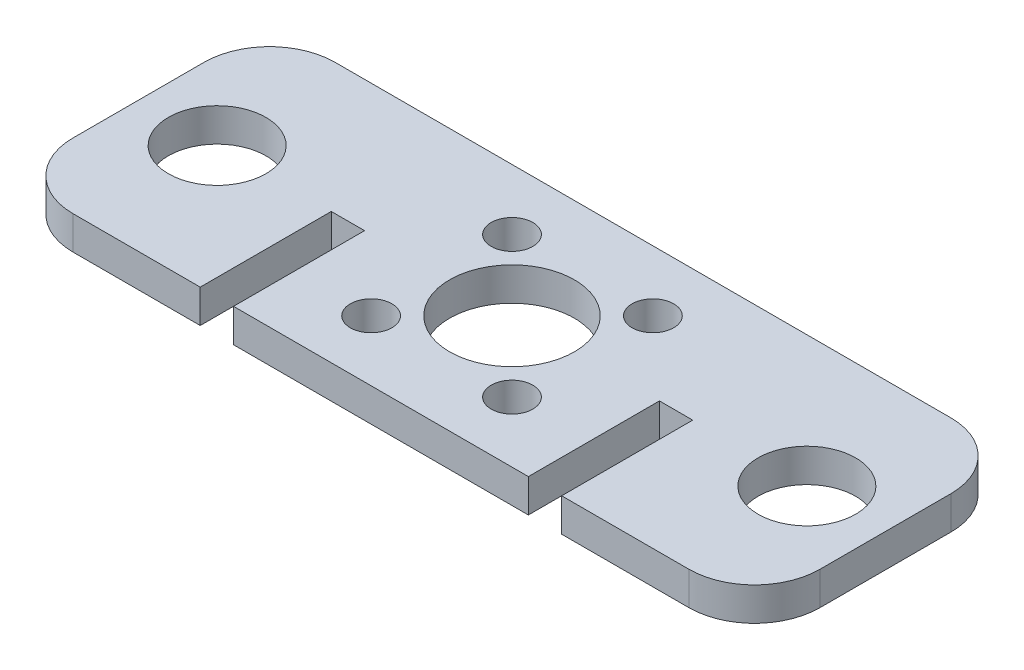
ISO-10303-21;
HEADER;
FILE_DESCRIPTION(('STEP AP214'),'2;1');
FILE_NAME('part.step','',(''),(''),'','','');
FILE_SCHEMA(('AUTOMOTIVE_DESIGN { 1 0 10303 214 1 1 1 1 }'));
ENDSEC;
DATA;
#1=APPLICATION_CONTEXT('core data for automotive mechanical design processes');
#2=APPLICATION_PROTOCOL_DEFINITION('international standard','automotive_design',2000,#1);
#3=PRODUCT_CONTEXT('',#1,'mechanical');
#4=PRODUCT('Part','Part','',(#3));
#5=PRODUCT_RELATED_PRODUCT_CATEGORY('part','',(#4));
#6=PRODUCT_DEFINITION_FORMATION('','',#4);
#7=PRODUCT_DEFINITION_CONTEXT('part definition',#1,'design');
#8=PRODUCT_DEFINITION('design','',#6,#7);
#9=PRODUCT_DEFINITION_SHAPE('','',#8);
#10=(LENGTH_UNIT() NAMED_UNIT(*) SI_UNIT(.MILLI.,.METRE.));
#11=(NAMED_UNIT(*) PLANE_ANGLE_UNIT() SI_UNIT($,.RADIAN.));
#12=(NAMED_UNIT(*) SI_UNIT($,.STERADIAN.) SOLID_ANGLE_UNIT());
#13=UNCERTAINTY_MEASURE_WITH_UNIT(LENGTH_MEASURE(1.E-05),#10,'distance_accuracy_value','');
#14=(GEOMETRIC_REPRESENTATION_CONTEXT(3) GLOBAL_UNCERTAINTY_ASSIGNED_CONTEXT((#13)) GLOBAL_UNIT_ASSIGNED_CONTEXT((#10,
#11,#12)) REPRESENTATION_CONTEXT('',''));
#15=CARTESIAN_POINT('',(0.,0.,0.));
#16=DIRECTION('',(0.,0.,1.));
#17=DIRECTION('',(1.,0.,0.));
#18=AXIS2_PLACEMENT_3D('',#15,#16,#17);
#19=CARTESIAN_POINT('',(57.,5.08,20.));
#20=DIRECTION('',(0.,0.,-1.));
#21=DIRECTION('',(-1.,0.,0.));
#22=AXIS2_PLACEMENT_3D('',#19,#20,#21);
#23=PLANE('',#22);
#24=DIRECTION('',(1.,0.,0.));
#25=VECTOR('',#24,1.);
#26=CARTESIAN_POINT('',(57.,5.08,20.));
#27=LINE('',#26,#25);
#28=CARTESIAN_POINT('',(27.58,5.08,20.));
#29=VERTEX_POINT('',#28);
#30=CARTESIAN_POINT('',(47.,5.08,20.));
#31=VERTEX_POINT('',#30);
#32=EDGE_CURVE('E232',#29,#31,#27,.T.);
#33=ORIENTED_EDGE('',*,*,#32,.F.);
#34=DIRECTION('',(0.,1.,0.));
#35=VECTOR('',#34,1.);
#36=CARTESIAN_POINT('',(27.58,0.,20.));
#37=LINE('',#36,#35);
#38=CARTESIAN_POINT('',(27.58,0.,20.));
#39=VERTEX_POINT('',#38);
#40=EDGE_CURVE('E181',#39,#29,#37,.T.);
#41=ORIENTED_EDGE('',*,*,#40,.F.);
#42=DIRECTION('',(1.,0.,0.));
#43=VECTOR('',#42,1.);
#44=CARTESIAN_POINT('',(57.,0.,20.));
#45=LINE('',#44,#43);
#46=CARTESIAN_POINT('',(47.,0.,20.));
#47=VERTEX_POINT('',#46);
#48=EDGE_CURVE('E169',#39,#47,#45,.T.);
#49=ORIENTED_EDGE('',*,*,#48,.T.);
#50=DIRECTION('',(0.,-1.,0.));
#51=VECTOR('',#50,1.);
#52=CARTESIAN_POINT('',(47.,5.08,20.));
#53=LINE('',#52,#51);
#54=EDGE_CURVE('E284',#47,#31,#53,.F.);
#55=ORIENTED_EDGE('',*,*,#54,.T.);
#56=EDGE_LOOP('',(#33,#41,#49,#55));
#57=FACE_BOUND('',#56,.T.);
#58=ADVANCED_FACE('F32',(#57),#23,.F.);
#59=CARTESIAN_POINT('',(-47.,0.,20.));
#60=VERTEX_POINT('',#59);
#61=CARTESIAN_POINT('',(-27.58,0.,20.));
#62=VERTEX_POINT('',#61);
#63=EDGE_CURVE('E247',#60,#62,#45,.T.);
#64=ORIENTED_EDGE('',*,*,#63,.T.);
#65=DIRECTION('',(0.,1.,0.));
#66=VECTOR('',#65,1.);
#67=CARTESIAN_POINT('',(-27.58,0.,20.));
#68=LINE('',#67,#66);
#69=CARTESIAN_POINT('',(-27.58,5.08,20.));
#70=VERTEX_POINT('',#69);
#71=EDGE_CURVE('E195',#62,#70,#68,.T.);
#72=ORIENTED_EDGE('',*,*,#71,.T.);
#73=CARTESIAN_POINT('',(-47.,5.08,20.));
#74=VERTEX_POINT('',#73);
#75=EDGE_CURVE('E234',#74,#70,#27,.T.);
#76=ORIENTED_EDGE('',*,*,#75,.F.);
#77=DIRECTION('',(0.,-1.,0.));
#78=VECTOR('',#77,1.);
#79=CARTESIAN_POINT('',(-47.,5.08,20.));
#80=LINE('',#79,#78);
#81=EDGE_CURVE('E281',#74,#60,#80,.T.);
#82=ORIENTED_EDGE('',*,*,#81,.T.);
#83=EDGE_LOOP('',(#64,#72,#76,#82));
#84=FACE_BOUND('',#83,.T.);
#85=ADVANCED_FACE('F302',(#84),#23,.F.);
#86=CARTESIAN_POINT('',(0.,5.08,0.));
#87=DIRECTION('',(0.,1.,0.));
#88=DIRECTION('',(0.,0.,1.));
#89=AXIS2_PLACEMENT_3D('',#86,#87,#88);
#90=PLANE('',#89);
#91=CARTESIAN_POINT('',(10.75,5.08,-10.75));
#92=DIRECTION('',(0.,1.,0.));
#93=DIRECTION('',(0.,0.,1.));
#94=AXIS2_PLACEMENT_3D('',#91,#92,#93);
#95=CIRCLE('',#94,3.175);
#96=CARTESIAN_POINT('',(10.75,5.08,-7.57499999999999));
#97=VERTEX_POINT('',#96);
#98=EDGE_CURVE('E548',#97,#97,#95,.T.);
#99=ORIENTED_EDGE('',*,*,#98,.F.);
#100=EDGE_LOOP('',(#99));
#101=FACE_BOUND('',#100,.T.);
#102=CARTESIAN_POINT('',(-10.75,5.08,-10.75));
#103=DIRECTION('',(0.,1.,0.));
#104=DIRECTION('',(0.,0.,1.));
#105=AXIS2_PLACEMENT_3D('',#102,#103,#104);
#106=CIRCLE('',#105,3.175);
#107=CARTESIAN_POINT('',(-10.75,5.08,-7.575));
#108=VERTEX_POINT('',#107);
#109=EDGE_CURVE('E550',#108,#108,#106,.T.);
#110=ORIENTED_EDGE('',*,*,#109,.F.);
#111=EDGE_LOOP('',(#110));
#112=FACE_BOUND('',#111,.T.);
#113=CARTESIAN_POINT('',(-10.75,5.08,10.75));
#114=DIRECTION('',(0.,1.,0.));
#115=DIRECTION('',(0.,0.,1.));
#116=AXIS2_PLACEMENT_3D('',#113,#114,#115);
#117=CIRCLE('',#116,3.175);
#118=CARTESIAN_POINT('',(-10.75,5.08,13.925));
#119=VERTEX_POINT('',#118);
#120=EDGE_CURVE('E556',#119,#119,#117,.T.);
#121=ORIENTED_EDGE('',*,*,#120,.F.);
#122=EDGE_LOOP('',(#121));
#123=FACE_BOUND('',#122,.T.);
#124=CARTESIAN_POINT('',(10.75,5.08,10.75));
#125=DIRECTION('',(0.,1.,0.));
#126=DIRECTION('',(0.,0.,1.));
#127=AXIS2_PLACEMENT_3D('',#124,#125,#126);
#128=CIRCLE('',#127,3.175);
#129=CARTESIAN_POINT('',(10.75,5.08,13.925));
#130=VERTEX_POINT('',#129);
#131=EDGE_CURVE('E174',#130,#130,#128,.T.);
#132=ORIENTED_EDGE('',*,*,#131,.F.);
#133=EDGE_LOOP('',(#132));
#134=FACE_BOUND('',#133,.T.);
#135=DIRECTION('',(0.,0.,-1.));
#136=VECTOR('',#135,1.);
#137=CARTESIAN_POINT('',(27.58,5.08,20.));
#138=LINE('',#137,#136);
#139=CARTESIAN_POINT('',(27.58,5.08,0.));
#140=VERTEX_POINT('',#139);
#141=EDGE_CURVE('E151',#29,#140,#138,.T.);
#142=ORIENTED_EDGE('',*,*,#141,.F.);
#143=ORIENTED_EDGE('',*,*,#32,.T.);
#144=CARTESIAN_POINT('',(47.,5.08,9.99999999999999));
#145=DIRECTION('',(0.,1.,0.));
#146=DIRECTION('',(0.,0.,1.));
#147=AXIS2_PLACEMENT_3D('',#144,#145,#146);
#148=CIRCLE('',#147,10.);
#149=CARTESIAN_POINT('',(57.,5.08,9.99999999999999));
#150=VERTEX_POINT('',#149);
#151=EDGE_CURVE('E277',#31,#150,#148,.T.);
#152=ORIENTED_EDGE('',*,*,#151,.T.);
#153=DIRECTION('',(0.,0.,-1.));
#154=VECTOR('',#153,1.);
#155=CARTESIAN_POINT('',(57.,5.08,20.));
#156=LINE('',#155,#154);
#157=CARTESIAN_POINT('',(57.,5.08,-10.));
#158=VERTEX_POINT('',#157);
#159=EDGE_CURVE('E237',#150,#158,#156,.T.);
#160=ORIENTED_EDGE('',*,*,#159,.T.);
#161=CARTESIAN_POINT('',(47.,5.08,-10.));
#162=DIRECTION('',(0.,1.,0.));
#163=DIRECTION('',(0.,0.,1.));
#164=AXIS2_PLACEMENT_3D('',#161,#162,#163);
#165=CIRCLE('',#164,10.);
#166=CARTESIAN_POINT('',(47.,5.08,-20.));
#167=VERTEX_POINT('',#166);
#168=EDGE_CURVE('E279',#158,#167,#165,.T.);
#169=ORIENTED_EDGE('',*,*,#168,.T.);
#170=DIRECTION('',(-1.,0.,0.));
#171=VECTOR('',#170,1.);
#172=CARTESIAN_POINT('',(57.,5.08,-20.));
#173=LINE('',#172,#171);
#174=CARTESIAN_POINT('',(-47.,5.08,-20.));
#175=VERTEX_POINT('',#174);
#176=EDGE_CURVE('E241',#167,#175,#173,.T.);
#177=ORIENTED_EDGE('',*,*,#176,.T.);
#178=CARTESIAN_POINT('',(-47.,5.08,-9.99999999999999));
#179=DIRECTION('',(0.,1.,0.));
#180=DIRECTION('',(0.,0.,1.));
#181=AXIS2_PLACEMENT_3D('',#178,#179,#180);
#182=CIRCLE('',#181,10.);
#183=CARTESIAN_POINT('',(-57.,5.08,-9.99999999999999));
#184=VERTEX_POINT('',#183);
#185=EDGE_CURVE('E275',#175,#184,#182,.T.);
#186=ORIENTED_EDGE('',*,*,#185,.T.);
#187=DIRECTION('',(0.,0.,1.));
#188=VECTOR('',#187,1.);
#189=CARTESIAN_POINT('',(-57.,5.08,20.));
#190=LINE('',#189,#188);
#191=CARTESIAN_POINT('',(-57.,5.08,10.));
#192=VERTEX_POINT('',#191);
#193=EDGE_CURVE('E229',#184,#192,#190,.T.);
#194=ORIENTED_EDGE('',*,*,#193,.T.);
#195=CARTESIAN_POINT('',(-47.,5.08,10.));
#196=DIRECTION('',(0.,1.,0.));
#197=DIRECTION('',(0.,0.,1.));
#198=AXIS2_PLACEMENT_3D('',#195,#196,#197);
#199=CIRCLE('',#198,10.);
#200=EDGE_CURVE('E273',#192,#74,#199,.T.);
#201=ORIENTED_EDGE('',*,*,#200,.T.);
#202=ORIENTED_EDGE('',*,*,#75,.T.);
#203=DIRECTION('',(0.,0.,1.));
#204=VECTOR('',#203,1.);
#205=CARTESIAN_POINT('',(-27.58,5.08,20.));
#206=LINE('',#205,#204);
#207=CARTESIAN_POINT('',(-27.58,5.08,0.));
#208=VERTEX_POINT('',#207);
#209=EDGE_CURVE('E183',#208,#70,#206,.T.);
#210=ORIENTED_EDGE('',*,*,#209,.F.);
#211=DIRECTION('',(-1.,0.,0.));
#212=VECTOR('',#211,1.);
#213=CARTESIAN_POINT('',(-27.58,5.08,0.));
#214=LINE('',#213,#212);
#215=CARTESIAN_POINT('',(-22.5,5.08,0.));
#216=VERTEX_POINT('',#215);
#217=EDGE_CURVE('E190',#216,#208,#214,.T.);
#218=ORIENTED_EDGE('',*,*,#217,.F.);
#219=DIRECTION('',(0.,0.,-1.));
#220=VECTOR('',#219,1.);
#221=CARTESIAN_POINT('',(-22.5,5.08,20.));
#222=LINE('',#221,#220);
#223=CARTESIAN_POINT('',(-22.5,5.08,20.));
#224=VERTEX_POINT('',#223);
#225=EDGE_CURVE('E197',#224,#216,#222,.T.);
#226=ORIENTED_EDGE('',*,*,#225,.F.);
#227=CARTESIAN_POINT('',(22.5,5.08,20.));
#228=VERTEX_POINT('',#227);
#229=EDGE_CURVE('E238',#224,#228,#27,.T.);
#230=ORIENTED_EDGE('',*,*,#229,.T.);
#231=DIRECTION('',(0.,0.,1.));
#232=VECTOR('',#231,1.);
#233=CARTESIAN_POINT('',(22.5,5.08,20.));
#234=LINE('',#233,#232);
#235=CARTESIAN_POINT('',(22.5,5.08,0.));
#236=VERTEX_POINT('',#235);
#237=EDGE_CURVE('E47',#236,#228,#234,.T.);
#238=ORIENTED_EDGE('',*,*,#237,.F.);
#239=DIRECTION('',(-1.,0.,0.));
#240=VECTOR('',#239,1.);
#241=CARTESIAN_POINT('',(27.58,5.08,0.));
#242=LINE('',#241,#240);
#243=EDGE_CURVE('E171',#140,#236,#242,.T.);
#244=ORIENTED_EDGE('',*,*,#243,.F.);
#245=EDGE_LOOP('',(#142,#143,#152,#160,#169,#177,#186,#194,#201,#202,#210,#218,#226,#230,#238,#244));
#246=FACE_BOUND('',#245,.T.);
#247=CARTESIAN_POINT('',(45.,5.08,0.));
#248=DIRECTION('',(0.,1.,0.));
#249=DIRECTION('',(0.,0.,1.));
#250=AXIS2_PLACEMENT_3D('',#247,#248,#249);
#251=CIRCLE('',#250,7.45000000000001);
#252=CARTESIAN_POINT('',(45.,5.08,7.45));
#253=VERTEX_POINT('',#252);
#254=EDGE_CURVE('E217',#253,#253,#251,.T.);
#255=ORIENTED_EDGE('',*,*,#254,.F.);
#256=EDGE_LOOP('',(#255));
#257=FACE_BOUND('',#256,.T.);
#258=CARTESIAN_POINT('',(-45.,5.08,0.));
#259=DIRECTION('',(0.,1.,0.));
#260=DIRECTION('',(0.,0.,1.));
#261=AXIS2_PLACEMENT_3D('',#258,#259,#260);
#262=CIRCLE('',#261,7.45);
#263=CARTESIAN_POINT('',(-45.,5.08,7.45));
#264=VERTEX_POINT('',#263);
#265=EDGE_CURVE('E223',#264,#264,#262,.T.);
#266=ORIENTED_EDGE('',*,*,#265,.F.);
#267=EDGE_LOOP('',(#266));
#268=FACE_BOUND('',#267,.T.);
#269=CARTESIAN_POINT('',(0.,5.08,0.));
#270=DIRECTION('',(0.,1.,0.));
#271=DIRECTION('',(0.,0.,1.));
#272=AXIS2_PLACEMENT_3D('',#269,#270,#271);
#273=CIRCLE('',#272,9.525);
#274=CARTESIAN_POINT('',(0.,5.08,9.525));
#275=VERTEX_POINT('',#274);
#276=EDGE_CURVE('E211',#275,#275,#273,.T.);
#277=ORIENTED_EDGE('',*,*,#276,.F.);
#278=EDGE_LOOP('',(#277));
#279=FACE_BOUND('',#278,.T.);
#280=ADVANCED_FACE('F295',(#101,#112,#123,#134,#246,#257,#268,#279),#90,.T.);
#281=CARTESIAN_POINT('',(0.,0.,0.));
#282=DIRECTION('',(0.,1.,0.));
#283=DIRECTION('',(0.,0.,1.));
#284=AXIS2_PLACEMENT_3D('',#281,#282,#283);
#285=PLANE('',#284);
#286=CARTESIAN_POINT('',(10.75,0.,-10.75));
#287=DIRECTION('',(0.,1.,0.));
#288=DIRECTION('',(0.,0.,1.));
#289=AXIS2_PLACEMENT_3D('',#286,#287,#288);
#290=CIRCLE('',#289,3.175);
#291=CARTESIAN_POINT('',(10.75,0.,-7.57499999999999));
#292=VERTEX_POINT('',#291);
#293=EDGE_CURVE('E545',#292,#292,#290,.T.);
#294=ORIENTED_EDGE('',*,*,#293,.T.);
#295=EDGE_LOOP('',(#294));
#296=FACE_BOUND('',#295,.T.);
#297=CARTESIAN_POINT('',(-10.75,0.,-10.75));
#298=DIRECTION('',(0.,1.,0.));
#299=DIRECTION('',(0.,0.,1.));
#300=AXIS2_PLACEMENT_3D('',#297,#298,#299);
#301=CIRCLE('',#300,3.175);
#302=CARTESIAN_POINT('',(-10.75,0.,-7.575));
#303=VERTEX_POINT('',#302);
#304=EDGE_CURVE('E553',#303,#303,#301,.T.);
#305=ORIENTED_EDGE('',*,*,#304,.T.);
#306=EDGE_LOOP('',(#305));
#307=FACE_BOUND('',#306,.T.);
#308=CARTESIAN_POINT('',(-10.75,0.,10.75));
#309=DIRECTION('',(0.,1.,0.));
#310=DIRECTION('',(0.,0.,1.));
#311=AXIS2_PLACEMENT_3D('',#308,#309,#310);
#312=CIRCLE('',#311,3.175);
#313=CARTESIAN_POINT('',(-10.75,0.,13.925));
#314=VERTEX_POINT('',#313);
#315=EDGE_CURVE('E559',#314,#314,#312,.T.);
#316=ORIENTED_EDGE('',*,*,#315,.T.);
#317=EDGE_LOOP('',(#316));
#318=FACE_BOUND('',#317,.T.);
#319=CARTESIAN_POINT('',(10.75,0.,10.75));
#320=DIRECTION('',(0.,1.,0.));
#321=DIRECTION('',(0.,0.,1.));
#322=AXIS2_PLACEMENT_3D('',#319,#320,#321);
#323=CIRCLE('',#322,3.175);
#324=CARTESIAN_POINT('',(10.75,0.,13.925));
#325=VERTEX_POINT('',#324);
#326=EDGE_CURVE('E179',#325,#325,#323,.T.);
#327=ORIENTED_EDGE('',*,*,#326,.T.);
#328=EDGE_LOOP('',(#327));
#329=FACE_BOUND('',#328,.T.);
#330=ORIENTED_EDGE('',*,*,#48,.F.);
#331=DIRECTION('',(0.,0.,-1.));
#332=VECTOR('',#331,1.);
#333=CARTESIAN_POINT('',(27.58,0.,20.));
#334=LINE('',#333,#332);
#335=CARTESIAN_POINT('',(27.58,0.,0.));
#336=VERTEX_POINT('',#335);
#337=EDGE_CURVE('E148',#39,#336,#334,.T.);
#338=ORIENTED_EDGE('',*,*,#337,.T.);
#339=DIRECTION('',(-1.,0.,0.));
#340=VECTOR('',#339,1.);
#341=CARTESIAN_POINT('',(27.58,0.,0.));
#342=LINE('',#341,#340);
#343=CARTESIAN_POINT('',(22.5,0.,0.));
#344=VERTEX_POINT('',#343);
#345=EDGE_CURVE('E159',#336,#344,#342,.T.);
#346=ORIENTED_EDGE('',*,*,#345,.T.);
#347=DIRECTION('',(0.,0.,1.));
#348=VECTOR('',#347,1.);
#349=CARTESIAN_POINT('',(22.5,0.,20.));
#350=LINE('',#349,#348);
#351=CARTESIAN_POINT('',(22.5,0.,20.));
#352=VERTEX_POINT('',#351);
#353=EDGE_CURVE('E156',#344,#352,#350,.T.);
#354=ORIENTED_EDGE('',*,*,#353,.T.);
#355=CARTESIAN_POINT('',(-22.5,0.,20.));
#356=VERTEX_POINT('',#355);
#357=EDGE_CURVE('E251',#356,#352,#45,.T.);
#358=ORIENTED_EDGE('',*,*,#357,.F.);
#359=DIRECTION('',(0.,0.,-1.));
#360=VECTOR('',#359,1.);
#361=CARTESIAN_POINT('',(-22.5,0.,20.));
#362=LINE('',#361,#360);
#363=CARTESIAN_POINT('',(-22.5,0.,0.));
#364=VERTEX_POINT('',#363);
#365=EDGE_CURVE('E55',#356,#364,#362,.T.);
#366=ORIENTED_EDGE('',*,*,#365,.T.);
#367=DIRECTION('',(-1.,0.,0.));
#368=VECTOR('',#367,1.);
#369=CARTESIAN_POINT('',(-27.58,0.,0.));
#370=LINE('',#369,#368);
#371=CARTESIAN_POINT('',(-27.58,0.,0.));
#372=VERTEX_POINT('',#371);
#373=EDGE_CURVE('E192',#364,#372,#370,.T.);
#374=ORIENTED_EDGE('',*,*,#373,.T.);
#375=DIRECTION('',(0.,0.,1.));
#376=VECTOR('',#375,1.);
#377=CARTESIAN_POINT('',(-27.58,0.,20.));
#378=LINE('',#377,#376);
#379=EDGE_CURVE('E187',#372,#62,#378,.T.);
#380=ORIENTED_EDGE('',*,*,#379,.T.);
#381=ORIENTED_EDGE('',*,*,#63,.F.);
#382=CARTESIAN_POINT('',(-47.,0.,10.));
#383=DIRECTION('',(0.,1.,0.));
#384=DIRECTION('',(0.,0.,1.));
#385=AXIS2_PLACEMENT_3D('',#382,#383,#384);
#386=CIRCLE('',#385,10.);
#387=CARTESIAN_POINT('',(-57.,0.,10.));
#388=VERTEX_POINT('',#387);
#389=EDGE_CURVE('E260',#60,#388,#386,.F.);
#390=ORIENTED_EDGE('',*,*,#389,.T.);
#391=DIRECTION('',(0.,0.,1.));
#392=VECTOR('',#391,1.);
#393=CARTESIAN_POINT('',(-57.,0.,20.));
#394=LINE('',#393,#392);
#395=CARTESIAN_POINT('',(-57.,0.,-9.99999999999999));
#396=VERTEX_POINT('',#395);
#397=EDGE_CURVE('E226',#396,#388,#394,.T.);
#398=ORIENTED_EDGE('',*,*,#397,.F.);
#399=CARTESIAN_POINT('',(-47.,0.,-9.99999999999999));
#400=DIRECTION('',(0.,1.,0.));
#401=DIRECTION('',(0.,0.,1.));
#402=AXIS2_PLACEMENT_3D('',#399,#400,#401);
#403=CIRCLE('',#402,10.);
#404=CARTESIAN_POINT('',(-47.,0.,-20.));
#405=VERTEX_POINT('',#404);
#406=EDGE_CURVE('E262',#396,#405,#403,.F.);
#407=ORIENTED_EDGE('',*,*,#406,.T.);
#408=DIRECTION('',(-1.,0.,0.));
#409=VECTOR('',#408,1.);
#410=CARTESIAN_POINT('',(57.,0.,-20.));
#411=LINE('',#410,#409);
#412=CARTESIAN_POINT('',(47.,0.,-20.));
#413=VERTEX_POINT('',#412);
#414=EDGE_CURVE('E233',#413,#405,#411,.T.);
#415=ORIENTED_EDGE('',*,*,#414,.F.);
#416=CARTESIAN_POINT('',(47.,0.,-10.));
#417=DIRECTION('',(0.,1.,0.));
#418=DIRECTION('',(0.,0.,1.));
#419=AXIS2_PLACEMENT_3D('',#416,#417,#418);
#420=CIRCLE('',#419,10.);
#421=CARTESIAN_POINT('',(57.,0.,-10.));
#422=VERTEX_POINT('',#421);
#423=EDGE_CURVE('E266',#413,#422,#420,.F.);
#424=ORIENTED_EDGE('',*,*,#423,.T.);
#425=DIRECTION('',(0.,0.,-1.));
#426=VECTOR('',#425,1.);
#427=CARTESIAN_POINT('',(57.,0.,20.));
#428=LINE('',#427,#426);
#429=CARTESIAN_POINT('',(57.,0.,9.99999999999999));
#430=VERTEX_POINT('',#429);
#431=EDGE_CURVE('E250',#430,#422,#428,.T.);
#432=ORIENTED_EDGE('',*,*,#431,.F.);
#433=CARTESIAN_POINT('',(47.,0.,9.99999999999999));
#434=DIRECTION('',(0.,1.,0.));
#435=DIRECTION('',(0.,0.,1.));
#436=AXIS2_PLACEMENT_3D('',#433,#434,#435);
#437=CIRCLE('',#436,10.);
#438=EDGE_CURVE('E264',#430,#47,#437,.F.);
#439=ORIENTED_EDGE('',*,*,#438,.T.);
#440=EDGE_LOOP('',(#330,#338,#346,#354,#358,#366,#374,#380,#381,#390,#398,#407,#415,#424,#432,#439));
#441=FACE_BOUND('',#440,.T.);
#442=CARTESIAN_POINT('',(-45.,0.,0.));
#443=DIRECTION('',(0.,1.,0.));
#444=DIRECTION('',(0.,0.,1.));
#445=AXIS2_PLACEMENT_3D('',#442,#443,#444);
#446=CIRCLE('',#445,7.45);
#447=CARTESIAN_POINT('',(-45.,0.,7.45));
#448=VERTEX_POINT('',#447);
#449=EDGE_CURVE('E220',#448,#448,#446,.T.);
#450=ORIENTED_EDGE('',*,*,#449,.T.);
#451=EDGE_LOOP('',(#450));
#452=FACE_BOUND('',#451,.T.);
#453=CARTESIAN_POINT('',(45.,0.,0.));
#454=DIRECTION('',(0.,1.,0.));
#455=DIRECTION('',(0.,0.,1.));
#456=AXIS2_PLACEMENT_3D('',#453,#454,#455);
#457=CIRCLE('',#456,7.45000000000001);
#458=CARTESIAN_POINT('',(45.,0.,7.45));
#459=VERTEX_POINT('',#458);
#460=EDGE_CURVE('E214',#459,#459,#457,.T.);
#461=ORIENTED_EDGE('',*,*,#460,.T.);
#462=EDGE_LOOP('',(#461));
#463=FACE_BOUND('',#462,.T.);
#464=CARTESIAN_POINT('',(0.,0.,0.));
#465=DIRECTION('',(0.,1.,0.));
#466=DIRECTION('',(0.,0.,1.));
#467=AXIS2_PLACEMENT_3D('',#464,#465,#466);
#468=CIRCLE('',#467,9.525);
#469=CARTESIAN_POINT('',(0.,0.,9.525));
#470=VERTEX_POINT('',#469);
#471=EDGE_CURVE('E204',#470,#470,#468,.T.);
#472=ORIENTED_EDGE('',*,*,#471,.T.);
#473=EDGE_LOOP('',(#472));
#474=FACE_BOUND('',#473,.T.);
#475=ADVANCED_FACE('F166',(#296,#307,#318,#329,#441,#452,#463,#474),#285,.F.);
#476=CARTESIAN_POINT('',(-57.,5.08,20.));
#477=DIRECTION('',(1.,0.,0.));
#478=DIRECTION('',(0.,0.,-1.));
#479=AXIS2_PLACEMENT_3D('',#476,#477,#478);
#480=PLANE('',#479);
#481=ORIENTED_EDGE('',*,*,#193,.F.);
#482=DIRECTION('',(0.,-1.,0.));
#483=VECTOR('',#482,1.);
#484=CARTESIAN_POINT('',(-57.,5.08,-9.99999999999999));
#485=LINE('',#484,#483);
#486=EDGE_CURVE('E11',#184,#396,#485,.T.);
#487=ORIENTED_EDGE('',*,*,#486,.T.);
#488=ORIENTED_EDGE('',*,*,#397,.T.);
#489=DIRECTION('',(0.,-1.,0.));
#490=VECTOR('',#489,1.);
#491=CARTESIAN_POINT('',(-57.,5.08,10.));
#492=LINE('',#491,#490);
#493=EDGE_CURVE('E40',#388,#192,#492,.F.);
#494=ORIENTED_EDGE('',*,*,#493,.T.);
#495=EDGE_LOOP('',(#481,#487,#488,#494));
#496=FACE_BOUND('',#495,.T.);
#497=ADVANCED_FACE('F289',(#496),#480,.F.);
#498=ORIENTED_EDGE('',*,*,#357,.T.);
#499=DIRECTION('',(0.,1.,0.));
#500=VECTOR('',#499,1.);
#501=CARTESIAN_POINT('',(22.5,0.,20.));
#502=LINE('',#501,#500);
#503=EDGE_CURVE('E184',#352,#228,#502,.T.);
#504=ORIENTED_EDGE('',*,*,#503,.T.);
#505=ORIENTED_EDGE('',*,*,#229,.F.);
#506=DIRECTION('',(0.,1.,0.));
#507=VECTOR('',#506,1.);
#508=CARTESIAN_POINT('',(-22.5,0.,20.));
#509=LINE('',#508,#507);
#510=EDGE_CURVE('E207',#356,#224,#509,.T.);
#511=ORIENTED_EDGE('',*,*,#510,.F.);
#512=EDGE_LOOP('',(#498,#504,#505,#511));
#513=FACE_BOUND('',#512,.T.);
#514=ADVANCED_FACE('F318',(#513),#23,.F.);
#515=CARTESIAN_POINT('',(57.,5.08,20.));
#516=DIRECTION('',(-1.,0.,0.));
#517=DIRECTION('',(0.,0.,1.));
#518=AXIS2_PLACEMENT_3D('',#515,#516,#517);
#519=PLANE('',#518);
#520=ORIENTED_EDGE('',*,*,#431,.T.);
#521=DIRECTION('',(0.,-1.,0.));
#522=VECTOR('',#521,1.);
#523=CARTESIAN_POINT('',(57.,5.08,-10.));
#524=LINE('',#523,#522);
#525=EDGE_CURVE('E271',#422,#158,#524,.F.);
#526=ORIENTED_EDGE('',*,*,#525,.T.);
#527=ORIENTED_EDGE('',*,*,#159,.F.);
#528=DIRECTION('',(0.,-1.,0.));
#529=VECTOR('',#528,1.);
#530=CARTESIAN_POINT('',(57.,5.08,9.99999999999999));
#531=LINE('',#530,#529);
#532=EDGE_CURVE('E268',#150,#430,#531,.T.);
#533=ORIENTED_EDGE('',*,*,#532,.T.);
#534=EDGE_LOOP('',(#520,#526,#527,#533));
#535=FACE_BOUND('',#534,.T.);
#536=ADVANCED_FACE('F330',(#535),#519,.F.);
#537=CARTESIAN_POINT('',(57.,5.08,-20.));
#538=DIRECTION('',(0.,0.,1.));
#539=DIRECTION('',(1.,0.,0.));
#540=AXIS2_PLACEMENT_3D('',#537,#538,#539);
#541=PLANE('',#540);
#542=ORIENTED_EDGE('',*,*,#176,.F.);
#543=DIRECTION('',(0.,-1.,0.));
#544=VECTOR('',#543,1.);
#545=CARTESIAN_POINT('',(47.,5.08,-20.));
#546=LINE('',#545,#544);
#547=EDGE_CURVE('E257',#167,#413,#546,.T.);
#548=ORIENTED_EDGE('',*,*,#547,.T.);
#549=ORIENTED_EDGE('',*,*,#414,.T.);
#550=DIRECTION('',(0.,-1.,0.));
#551=VECTOR('',#550,1.);
#552=CARTESIAN_POINT('',(-47.,5.08,-20.));
#553=LINE('',#552,#551);
#554=EDGE_CURVE('E244',#405,#175,#553,.F.);
#555=ORIENTED_EDGE('',*,*,#554,.T.);
#556=EDGE_LOOP('',(#542,#548,#549,#555));
#557=FACE_BOUND('',#556,.T.);
#558=ADVANCED_FACE('F337',(#557),#541,.F.);
#559=CARTESIAN_POINT('',(-45.,5.08,0.));
#560=DIRECTION('',(0.,-1.,0.));
#561=DIRECTION('',(0.,0.,-1.));
#562=AXIS2_PLACEMENT_3D('',#559,#560,#561);
#563=CYLINDRICAL_SURFACE('',#562,7.45);
#564=ORIENTED_EDGE('',*,*,#265,.T.);
#565=EDGE_LOOP('',(#564));
#566=FACE_BOUND('',#565,.T.);
#567=ORIENTED_EDGE('',*,*,#449,.F.);
#568=EDGE_LOOP('',(#567));
#569=FACE_BOUND('',#568,.T.);
#570=ADVANCED_FACE('F380',(#566,#569),#563,.F.);
#571=CARTESIAN_POINT('',(45.,5.08,0.));
#572=DIRECTION('',(0.,-1.,0.));
#573=DIRECTION('',(0.,0.,-1.));
#574=AXIS2_PLACEMENT_3D('',#571,#572,#573);
#575=CYLINDRICAL_SURFACE('',#574,7.45000000000001);
#576=ORIENTED_EDGE('',*,*,#254,.T.);
#577=EDGE_LOOP('',(#576));
#578=FACE_BOUND('',#577,.T.);
#579=ORIENTED_EDGE('',*,*,#460,.F.);
#580=EDGE_LOOP('',(#579));
#581=FACE_BOUND('',#580,.T.);
#582=ADVANCED_FACE('F374',(#578,#581),#575,.F.);
#583=CARTESIAN_POINT('',(0.,5.08,0.));
#584=DIRECTION('',(0.,-1.,0.));
#585=DIRECTION('',(0.,0.,-1.));
#586=AXIS2_PLACEMENT_3D('',#583,#584,#585);
#587=CYLINDRICAL_SURFACE('',#586,9.525);
#588=ORIENTED_EDGE('',*,*,#276,.T.);
#589=EDGE_LOOP('',(#588));
#590=FACE_BOUND('',#589,.T.);
#591=ORIENTED_EDGE('',*,*,#471,.F.);
#592=EDGE_LOOP('',(#591));
#593=FACE_BOUND('',#592,.T.);
#594=ADVANCED_FACE('F370',(#590,#593),#587,.F.);
#595=CARTESIAN_POINT('',(47.,5.08,-10.));
#596=DIRECTION('',(0.,-1.,0.));
#597=DIRECTION('',(0.,0.,-1.));
#598=AXIS2_PLACEMENT_3D('',#595,#596,#597);
#599=CYLINDRICAL_SURFACE('',#598,10.);
#600=ORIENTED_EDGE('',*,*,#168,.F.);
#601=ORIENTED_EDGE('',*,*,#525,.F.);
#602=ORIENTED_EDGE('',*,*,#423,.F.);
#603=ORIENTED_EDGE('',*,*,#547,.F.);
#604=EDGE_LOOP('',(#600,#601,#602,#603));
#605=FACE_BOUND('',#604,.T.);
#606=ADVANCED_FACE('F333',(#605),#599,.T.);
#607=CARTESIAN_POINT('',(47.,5.08,9.99999999999999));
#608=DIRECTION('',(0.,-1.,0.));
#609=DIRECTION('',(0.,0.,-1.));
#610=AXIS2_PLACEMENT_3D('',#607,#608,#609);
#611=CYLINDRICAL_SURFACE('',#610,10.);
#612=ORIENTED_EDGE('',*,*,#151,.F.);
#613=ORIENTED_EDGE('',*,*,#54,.F.);
#614=ORIENTED_EDGE('',*,*,#438,.F.);
#615=ORIENTED_EDGE('',*,*,#532,.F.);
#616=EDGE_LOOP('',(#612,#613,#614,#615));
#617=FACE_BOUND('',#616,.T.);
#618=ADVANCED_FACE('F326',(#617),#611,.T.);
#619=CARTESIAN_POINT('',(-47.,5.08,-9.99999999999999));
#620=DIRECTION('',(0.,-1.,0.));
#621=DIRECTION('',(0.,0.,-1.));
#622=AXIS2_PLACEMENT_3D('',#619,#620,#621);
#623=CYLINDRICAL_SURFACE('',#622,10.);
#624=ORIENTED_EDGE('',*,*,#185,.F.);
#625=ORIENTED_EDGE('',*,*,#554,.F.);
#626=ORIENTED_EDGE('',*,*,#406,.F.);
#627=ORIENTED_EDGE('',*,*,#486,.F.);
#628=EDGE_LOOP('',(#624,#625,#626,#627));
#629=FACE_BOUND('',#628,.T.);
#630=ADVANCED_FACE('F341',(#629),#623,.T.);
#631=CARTESIAN_POINT('',(-47.,5.08,10.));
#632=DIRECTION('',(0.,-1.,0.));
#633=DIRECTION('',(0.,0.,-1.));
#634=AXIS2_PLACEMENT_3D('',#631,#632,#633);
#635=CYLINDRICAL_SURFACE('',#634,10.);
#636=ORIENTED_EDGE('',*,*,#200,.F.);
#637=ORIENTED_EDGE('',*,*,#493,.F.);
#638=ORIENTED_EDGE('',*,*,#389,.F.);
#639=ORIENTED_EDGE('',*,*,#81,.F.);
#640=EDGE_LOOP('',(#636,#637,#638,#639));
#641=FACE_BOUND('',#640,.T.);
#642=ADVANCED_FACE('F34',(#641),#635,.T.);
#643=CARTESIAN_POINT('',(-27.58,0.,20.));
#644=DIRECTION('',(-1.,0.,0.));
#645=DIRECTION('',(0.,0.,1.));
#646=AXIS2_PLACEMENT_3D('',#643,#644,#645);
#647=PLANE('',#646);
#648=ORIENTED_EDGE('',*,*,#209,.T.);
#649=ORIENTED_EDGE('',*,*,#71,.F.);
#650=ORIENTED_EDGE('',*,*,#379,.F.);
#651=DIRECTION('',(0.,1.,0.));
#652=VECTOR('',#651,1.);
#653=CARTESIAN_POINT('',(-27.58,0.,0.));
#654=LINE('',#653,#652);
#655=EDGE_CURVE('E202',#372,#208,#654,.T.);
#656=ORIENTED_EDGE('',*,*,#655,.T.);
#657=EDGE_LOOP('',(#648,#649,#650,#656));
#658=FACE_BOUND('',#657,.T.);
#659=ADVANCED_FACE('F306',(#658),#647,.F.);
#660=CARTESIAN_POINT('',(-27.58,0.,0.));
#661=DIRECTION('',(0.,0.,-1.));
#662=DIRECTION('',(-1.,0.,0.));
#663=AXIS2_PLACEMENT_3D('',#660,#661,#662);
#664=PLANE('',#663);
#665=ORIENTED_EDGE('',*,*,#217,.T.);
#666=ORIENTED_EDGE('',*,*,#655,.F.);
#667=ORIENTED_EDGE('',*,*,#373,.F.);
#668=DIRECTION('',(0.,1.,0.));
#669=VECTOR('',#668,1.);
#670=CARTESIAN_POINT('',(-22.5,0.,0.));
#671=LINE('',#670,#669);
#672=EDGE_CURVE('E205',#364,#216,#671,.T.);
#673=ORIENTED_EDGE('',*,*,#672,.T.);
#674=EDGE_LOOP('',(#665,#666,#667,#673));
#675=FACE_BOUND('',#674,.T.);
#676=ADVANCED_FACE('F313',(#675),#664,.F.);
#677=CARTESIAN_POINT('',(-22.5,0.,20.));
#678=DIRECTION('',(1.,0.,0.));
#679=DIRECTION('',(0.,0.,-1.));
#680=AXIS2_PLACEMENT_3D('',#677,#678,#679);
#681=PLANE('',#680);
#682=ORIENTED_EDGE('',*,*,#225,.T.);
#683=ORIENTED_EDGE('',*,*,#672,.F.);
#684=ORIENTED_EDGE('',*,*,#365,.F.);
#685=ORIENTED_EDGE('',*,*,#510,.T.);
#686=EDGE_LOOP('',(#682,#683,#684,#685));
#687=FACE_BOUND('',#686,.T.);
#688=ADVANCED_FACE('F314',(#687),#681,.F.);
#689=CARTESIAN_POINT('',(27.58,0.,20.));
#690=DIRECTION('',(1.,0.,0.));
#691=DIRECTION('',(0.,0.,-1.));
#692=AXIS2_PLACEMENT_3D('',#689,#690,#691);
#693=PLANE('',#692);
#694=ORIENTED_EDGE('',*,*,#141,.T.);
#695=DIRECTION('',(0.,1.,0.));
#696=VECTOR('',#695,1.);
#697=CARTESIAN_POINT('',(27.58,0.,0.));
#698=LINE('',#697,#696);
#699=EDGE_CURVE('E144',#336,#140,#698,.T.);
#700=ORIENTED_EDGE('',*,*,#699,.F.);
#701=ORIENTED_EDGE('',*,*,#337,.F.);
#702=ORIENTED_EDGE('',*,*,#40,.T.);
#703=EDGE_LOOP('',(#694,#700,#701,#702));
#704=FACE_BOUND('',#703,.T.);
#705=ADVANCED_FACE('F146',(#704),#693,.F.);
#706=CARTESIAN_POINT('',(22.5,0.,20.));
#707=DIRECTION('',(-1.,0.,0.));
#708=DIRECTION('',(0.,0.,1.));
#709=AXIS2_PLACEMENT_3D('',#706,#707,#708);
#710=PLANE('',#709);
#711=ORIENTED_EDGE('',*,*,#237,.T.);
#712=ORIENTED_EDGE('',*,*,#503,.F.);
#713=ORIENTED_EDGE('',*,*,#353,.F.);
#714=DIRECTION('',(0.,1.,0.));
#715=VECTOR('',#714,1.);
#716=CARTESIAN_POINT('',(22.5,0.,0.));
#717=LINE('',#716,#715);
#718=EDGE_CURVE('E155',#344,#236,#717,.T.);
#719=ORIENTED_EDGE('',*,*,#718,.T.);
#720=EDGE_LOOP('',(#711,#712,#713,#719));
#721=FACE_BOUND('',#720,.T.);
#722=ADVANCED_FACE('F480',(#721),#710,.F.);
#723=CARTESIAN_POINT('',(27.58,0.,0.));
#724=DIRECTION('',(0.,0.,-1.));
#725=DIRECTION('',(-1.,0.,0.));
#726=AXIS2_PLACEMENT_3D('',#723,#724,#725);
#727=PLANE('',#726);
#728=ORIENTED_EDGE('',*,*,#243,.T.);
#729=ORIENTED_EDGE('',*,*,#718,.F.);
#730=ORIENTED_EDGE('',*,*,#345,.F.);
#731=ORIENTED_EDGE('',*,*,#699,.T.);
#732=EDGE_LOOP('',(#728,#729,#730,#731));
#733=FACE_BOUND('',#732,.T.);
#734=ADVANCED_FACE('F160',(#733),#727,.F.);
#735=CARTESIAN_POINT('',(10.75,0.,10.75));
#736=DIRECTION('',(0.,1.,0.));
#737=DIRECTION('',(0.,0.,1.));
#738=AXIS2_PLACEMENT_3D('',#735,#736,#737);
#739=CYLINDRICAL_SURFACE('',#738,3.175);
#740=ORIENTED_EDGE('',*,*,#326,.F.);
#741=EDGE_LOOP('',(#740));
#742=FACE_BOUND('',#741,.T.);
#743=ORIENTED_EDGE('',*,*,#131,.T.);
#744=EDGE_LOOP('',(#743));
#745=FACE_BOUND('',#744,.T.);
#746=ADVANCED_FACE('F495',(#742,#745),#739,.F.);
#747=CARTESIAN_POINT('',(-10.75,0.,10.75));
#748=DIRECTION('',(0.,1.,0.));
#749=DIRECTION('',(0.,0.,1.));
#750=AXIS2_PLACEMENT_3D('',#747,#748,#749);
#751=CYLINDRICAL_SURFACE('',#750,3.175);
#752=ORIENTED_EDGE('',*,*,#315,.F.);
#753=EDGE_LOOP('',(#752));
#754=FACE_BOUND('',#753,.T.);
#755=ORIENTED_EDGE('',*,*,#120,.T.);
#756=EDGE_LOOP('',(#755));
#757=FACE_BOUND('',#756,.T.);
#758=ADVANCED_FACE('F503',(#754,#757),#751,.F.);
#759=CARTESIAN_POINT('',(-10.75,0.,-10.75));
#760=DIRECTION('',(0.,1.,0.));
#761=DIRECTION('',(0.,0.,1.));
#762=AXIS2_PLACEMENT_3D('',#759,#760,#761);
#763=CYLINDRICAL_SURFACE('',#762,3.175);
#764=ORIENTED_EDGE('',*,*,#304,.F.);
#765=EDGE_LOOP('',(#764));
#766=FACE_BOUND('',#765,.T.);
#767=ORIENTED_EDGE('',*,*,#109,.T.);
#768=EDGE_LOOP('',(#767));
#769=FACE_BOUND('',#768,.T.);
#770=ADVANCED_FACE('F512',(#766,#769),#763,.F.);
#771=CARTESIAN_POINT('',(10.75,0.,-10.75));
#772=DIRECTION('',(0.,1.,0.));
#773=DIRECTION('',(0.,0.,1.));
#774=AXIS2_PLACEMENT_3D('',#771,#772,#773);
#775=CYLINDRICAL_SURFACE('',#774,3.175);
#776=ORIENTED_EDGE('',*,*,#293,.F.);
#777=EDGE_LOOP('',(#776));
#778=FACE_BOUND('',#777,.T.);
#779=ORIENTED_EDGE('',*,*,#98,.T.);
#780=EDGE_LOOP('',(#779));
#781=FACE_BOUND('',#780,.T.);
#782=ADVANCED_FACE('F521',(#778,#781),#775,.F.);
#783=CLOSED_SHELL('',(#58,#85,#280,#475,#497,#514,#536,#558,#570,#582,#594,#606,#618,#630,#642,
#659,#676,#688,#705,#722,#734,#746,#758,#770,#782));
#784=MANIFOLD_SOLID_BREP('B2',#783);
#785=ADVANCED_BREP_SHAPE_REPRESENTATION('',(#18,#784),#14);
#786=SHAPE_DEFINITION_REPRESENTATION(#9,#785);
ENDSEC;
END-ISO-10303-21;
